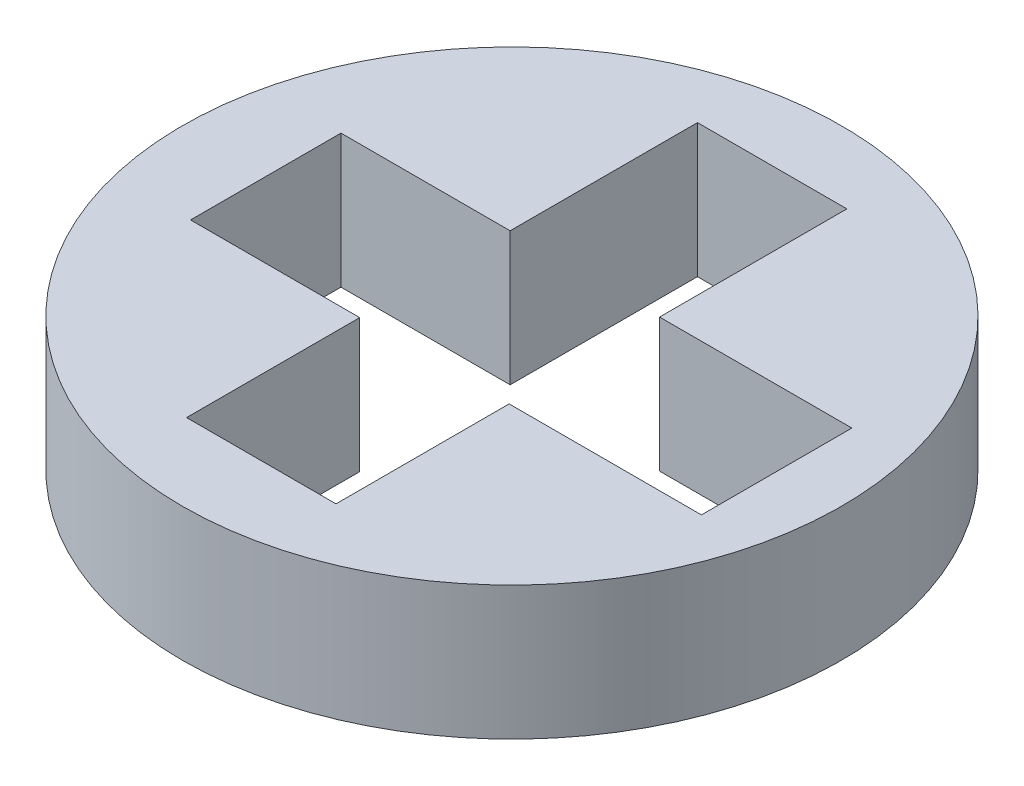
ISO-10303-21;
HEADER;
FILE_DESCRIPTION(('STEP AP214'),'2;1');
FILE_NAME('part.step','',(''),(''),'','','');
FILE_SCHEMA(('AUTOMOTIVE_DESIGN { 1 0 10303 214 1 1 1 1 }'));
ENDSEC;
DATA;
#1=APPLICATION_CONTEXT('core data for automotive mechanical design processes');
#2=APPLICATION_PROTOCOL_DEFINITION('international standard','automotive_design',2000,#1);
#3=PRODUCT_CONTEXT('',#1,'mechanical');
#4=PRODUCT('Part','Part','',(#3));
#5=PRODUCT_RELATED_PRODUCT_CATEGORY('part','',(#4));
#6=PRODUCT_DEFINITION_FORMATION('','',#4);
#7=PRODUCT_DEFINITION_CONTEXT('part definition',#1,'design');
#8=PRODUCT_DEFINITION('design','',#6,#7);
#9=PRODUCT_DEFINITION_SHAPE('','',#8);
#10=(LENGTH_UNIT() NAMED_UNIT(*) SI_UNIT(.MILLI.,.METRE.));
#11=(NAMED_UNIT(*) PLANE_ANGLE_UNIT() SI_UNIT($,.RADIAN.));
#12=(NAMED_UNIT(*) SI_UNIT($,.STERADIAN.) SOLID_ANGLE_UNIT());
#13=UNCERTAINTY_MEASURE_WITH_UNIT(LENGTH_MEASURE(1.E-05),#10,'distance_accuracy_value','');
#14=(GEOMETRIC_REPRESENTATION_CONTEXT(3) GLOBAL_UNCERTAINTY_ASSIGNED_CONTEXT((#13)) GLOBAL_UNIT_ASSIGNED_CONTEXT((#10,
#11,#12)) REPRESENTATION_CONTEXT('',''));
#15=CARTESIAN_POINT('',(0.,0.,0.));
#16=DIRECTION('',(0.,0.,1.));
#17=DIRECTION('',(1.,0.,0.));
#18=AXIS2_PLACEMENT_3D('',#15,#16,#17);
#19=CARTESIAN_POINT('',(0.,1.,-1.95043882679258));
#20=DIRECTION('',(0.,0.,-1.));
#21=DIRECTION('',(-1.,0.,0.));
#22=AXIS2_PLACEMENT_3D('',#19,#20,#21);
#23=PLANE('',#22);
#24=DIRECTION('',(1.,0.,0.));
#25=VECTOR('',#24,1.);
#26=CARTESIAN_POINT('',(0.,0.,-1.95043882679258));
#27=LINE('',#26,#25);
#28=CARTESIAN_POINT('',(-0.56,0.,-1.95043882679258));
#29=VERTEX_POINT('',#28);
#30=CARTESIAN_POINT('',(0.56,0.,-1.95043882679258));
#31=VERTEX_POINT('',#30);
#32=EDGE_CURVE('E176',#29,#31,#27,.T.);
#33=ORIENTED_EDGE('',*,*,#32,.T.);
#34=DIRECTION('',(0.,-1.,0.));
#35=VECTOR('',#34,1.);
#36=CARTESIAN_POINT('',(0.56,1.,-1.95043882679258));
#37=LINE('',#36,#35);
#38=CARTESIAN_POINT('',(0.56,1.,-1.95043882679258));
#39=VERTEX_POINT('',#38);
#40=EDGE_CURVE('E11',#39,#31,#37,.T.);
#41=ORIENTED_EDGE('',*,*,#40,.F.);
#42=DIRECTION('',(1.,0.,0.));
#43=VECTOR('',#42,1.);
#44=CARTESIAN_POINT('',(0.,1.,-1.95043882679258));
#45=LINE('',#44,#43);
#46=CARTESIAN_POINT('',(-0.56,1.,-1.95043882679258));
#47=VERTEX_POINT('',#46);
#48=EDGE_CURVE('E211',#47,#39,#45,.T.);
#49=ORIENTED_EDGE('',*,*,#48,.F.);
#50=DIRECTION('',(0.,-1.,0.));
#51=VECTOR('',#50,1.);
#52=CARTESIAN_POINT('',(-0.56,1.,-1.95043882679258));
#53=LINE('',#52,#51);
#54=EDGE_CURVE('E58',#47,#29,#53,.T.);
#55=ORIENTED_EDGE('',*,*,#54,.T.);
#56=EDGE_LOOP('',(#33,#41,#49,#55));
#57=FACE_BOUND('',#56,.T.);
#58=ADVANCED_FACE('F41',(#57),#23,.F.);
#59=CARTESIAN_POINT('',(0.56,1.,0.));
#60=DIRECTION('',(1.,0.,0.));
#61=DIRECTION('',(0.,0.,-1.));
#62=AXIS2_PLACEMENT_3D('',#59,#60,#61);
#63=PLANE('',#62);
#64=DIRECTION('',(0.,0.,1.));
#65=VECTOR('',#64,1.);
#66=CARTESIAN_POINT('',(0.56,0.,0.));
#67=LINE('',#66,#65);
#68=CARTESIAN_POINT('',(0.56,0.,-0.546492652772135));
#69=VERTEX_POINT('',#68);
#70=EDGE_CURVE('E179',#31,#69,#67,.T.);
#71=ORIENTED_EDGE('',*,*,#70,.T.);
#72=DIRECTION('',(0.,-1.,0.));
#73=VECTOR('',#72,1.);
#74=CARTESIAN_POINT('',(0.56,1.,-0.546492652772135));
#75=LINE('',#74,#73);
#76=CARTESIAN_POINT('',(0.56,1.,-0.546492652772135));
#77=VERTEX_POINT('',#76);
#78=EDGE_CURVE('E50',#77,#69,#75,.T.);
#79=ORIENTED_EDGE('',*,*,#78,.F.);
#80=DIRECTION('',(0.,0.,1.));
#81=VECTOR('',#80,1.);
#82=CARTESIAN_POINT('',(0.56,1.,0.));
#83=LINE('',#82,#81);
#84=EDGE_CURVE('E109',#39,#77,#83,.T.);
#85=ORIENTED_EDGE('',*,*,#84,.F.);
#86=ORIENTED_EDGE('',*,*,#40,.T.);
#87=EDGE_LOOP('',(#71,#79,#85,#86));
#88=FACE_BOUND('',#87,.T.);
#89=ADVANCED_FACE('F276',(#88),#63,.F.);
#90=CARTESIAN_POINT('',(0.,1.,-0.546492652772135));
#91=DIRECTION('',(0.,0.,-1.));
#92=DIRECTION('',(-1.,0.,0.));
#93=AXIS2_PLACEMENT_3D('',#90,#91,#92);
#94=PLANE('',#93);
#95=DIRECTION('',(1.,0.,0.));
#96=VECTOR('',#95,1.);
#97=CARTESIAN_POINT('',(0.,0.,-0.546492652772135));
#98=LINE('',#97,#96);
#99=CARTESIAN_POINT('',(2.00120009186934,0.,-0.546492652772135));
#100=VERTEX_POINT('',#99);
#101=EDGE_CURVE('E182',#69,#100,#98,.T.);
#102=ORIENTED_EDGE('',*,*,#101,.T.);
#103=DIRECTION('',(0.,-1.,0.));
#104=VECTOR('',#103,1.);
#105=CARTESIAN_POINT('',(2.00120009186934,1.,-0.546492652772135));
#106=LINE('',#105,#104);
#107=CARTESIAN_POINT('',(2.00120009186934,1.,-0.546492652772135));
#108=VERTEX_POINT('',#107);
#109=EDGE_CURVE('E233',#108,#100,#106,.T.);
#110=ORIENTED_EDGE('',*,*,#109,.F.);
#111=DIRECTION('',(1.,0.,0.));
#112=VECTOR('',#111,1.);
#113=CARTESIAN_POINT('',(0.,1.,-0.546492652772135));
#114=LINE('',#113,#112);
#115=EDGE_CURVE('E156',#77,#108,#114,.T.);
#116=ORIENTED_EDGE('',*,*,#115,.F.);
#117=ORIENTED_EDGE('',*,*,#78,.T.);
#118=EDGE_LOOP('',(#102,#110,#116,#117));
#119=FACE_BOUND('',#118,.T.);
#120=ADVANCED_FACE('F241',(#119),#94,.F.);
#121=CARTESIAN_POINT('',(2.00120009186934,1.,0.));
#122=DIRECTION('',(1.,0.,0.));
#123=DIRECTION('',(0.,0.,-1.));
#124=AXIS2_PLACEMENT_3D('',#121,#122,#123);
#125=PLANE('',#124);
#126=DIRECTION('',(0.,0.,1.));
#127=VECTOR('',#126,1.);
#128=CARTESIAN_POINT('',(2.00120009186934,0.,0.));
#129=LINE('',#128,#127);
#130=CARTESIAN_POINT('',(2.00120009186934,0.,0.580830581006816));
#131=VERTEX_POINT('',#130);
#132=EDGE_CURVE('E186',#100,#131,#129,.T.);
#133=ORIENTED_EDGE('',*,*,#132,.T.);
#134=DIRECTION('',(0.,-1.,0.));
#135=VECTOR('',#134,1.);
#136=CARTESIAN_POINT('',(2.00120009186934,1.,0.580830581006816));
#137=LINE('',#136,#135);
#138=CARTESIAN_POINT('',(2.00120009186934,1.,0.580830581006816));
#139=VERTEX_POINT('',#138);
#140=EDGE_CURVE('E230',#139,#131,#137,.T.);
#141=ORIENTED_EDGE('',*,*,#140,.F.);
#142=DIRECTION('',(0.,0.,1.));
#143=VECTOR('',#142,1.);
#144=CARTESIAN_POINT('',(2.00120009186934,1.,0.));
#145=LINE('',#144,#143);
#146=EDGE_CURVE('E254',#108,#139,#145,.T.);
#147=ORIENTED_EDGE('',*,*,#146,.F.);
#148=ORIENTED_EDGE('',*,*,#109,.T.);
#149=EDGE_LOOP('',(#133,#141,#147,#148));
#150=FACE_BOUND('',#149,.T.);
#151=ADVANCED_FACE('F251',(#150),#125,.F.);
#152=CARTESIAN_POINT('',(0.,1.,0.580830581006818));
#153=DIRECTION('',(0.,0.,-1.));
#154=DIRECTION('',(-1.,0.,0.));
#155=AXIS2_PLACEMENT_3D('',#152,#153,#154);
#156=PLANE('',#155);
#157=DIRECTION('',(1.,0.,0.));
#158=VECTOR('',#157,1.);
#159=CARTESIAN_POINT('',(0.,0.,0.580830581006818));
#160=LINE('',#159,#158);
#161=CARTESIAN_POINT('',(0.56,0.,0.580830581006817));
#162=VERTEX_POINT('',#161);
#163=EDGE_CURVE('E191',#162,#131,#160,.T.);
#164=ORIENTED_EDGE('',*,*,#163,.F.);
#165=DIRECTION('',(0.,-1.,0.));
#166=VECTOR('',#165,1.);
#167=CARTESIAN_POINT('',(0.56,1.,0.580830581006817));
#168=LINE('',#167,#166);
#169=CARTESIAN_POINT('',(0.56,1.,0.580830581006817));
#170=VERTEX_POINT('',#169);
#171=EDGE_CURVE('E227',#170,#162,#168,.T.);
#172=ORIENTED_EDGE('',*,*,#171,.F.);
#173=DIRECTION('',(1.,0.,0.));
#174=VECTOR('',#173,1.);
#175=CARTESIAN_POINT('',(0.,1.,0.580830581006818));
#176=LINE('',#175,#174);
#177=EDGE_CURVE('E168',#170,#139,#176,.T.);
#178=ORIENTED_EDGE('',*,*,#177,.T.);
#179=ORIENTED_EDGE('',*,*,#140,.T.);
#180=EDGE_LOOP('',(#164,#172,#178,#179));
#181=FACE_BOUND('',#180,.T.);
#182=ADVANCED_FACE('F288',(#181),#156,.T.);
#183=CARTESIAN_POINT('',(0.56,0.,1.87856472751946));
#184=VERTEX_POINT('',#183);
#185=EDGE_CURVE('E183',#162,#184,#67,.T.);
#186=ORIENTED_EDGE('',*,*,#185,.T.);
#187=DIRECTION('',(0.,-1.,0.));
#188=VECTOR('',#187,1.);
#189=CARTESIAN_POINT('',(0.56,1.,1.87856472751946));
#190=LINE('',#189,#188);
#191=CARTESIAN_POINT('',(0.56,1.,1.87856472751946));
#192=VERTEX_POINT('',#191);
#193=EDGE_CURVE('E224',#192,#184,#190,.T.);
#194=ORIENTED_EDGE('',*,*,#193,.F.);
#195=EDGE_CURVE('E260',#170,#192,#83,.T.);
#196=ORIENTED_EDGE('',*,*,#195,.F.);
#197=ORIENTED_EDGE('',*,*,#171,.T.);
#198=EDGE_LOOP('',(#186,#194,#196,#197));
#199=FACE_BOUND('',#198,.T.);
#200=ADVANCED_FACE('F279',(#199),#63,.F.);
#201=CARTESIAN_POINT('',(0.,1.,1.87856472751946));
#202=DIRECTION('',(0.,0.,-1.));
#203=DIRECTION('',(-1.,0.,0.));
#204=AXIS2_PLACEMENT_3D('',#201,#202,#203);
#205=PLANE('',#204);
#206=DIRECTION('',(1.,0.,0.));
#207=VECTOR('',#206,1.);
#208=CARTESIAN_POINT('',(0.,0.,1.87856472751946));
#209=LINE('',#208,#207);
#210=CARTESIAN_POINT('',(-0.56,0.,1.87856472751946));
#211=VERTEX_POINT('',#210);
#212=EDGE_CURVE('E196',#211,#184,#209,.T.);
#213=ORIENTED_EDGE('',*,*,#212,.F.);
#214=DIRECTION('',(0.,-1.,0.));
#215=VECTOR('',#214,1.);
#216=CARTESIAN_POINT('',(-0.56,1.,1.87856472751946));
#217=LINE('',#216,#215);
#218=CARTESIAN_POINT('',(-0.56,1.,1.87856472751946));
#219=VERTEX_POINT('',#218);
#220=EDGE_CURVE('E221',#219,#211,#217,.T.);
#221=ORIENTED_EDGE('',*,*,#220,.F.);
#222=DIRECTION('',(1.,0.,0.));
#223=VECTOR('',#222,1.);
#224=CARTESIAN_POINT('',(0.,1.,1.87856472751946));
#225=LINE('',#224,#223);
#226=EDGE_CURVE('E262',#219,#192,#225,.T.);
#227=ORIENTED_EDGE('',*,*,#226,.T.);
#228=ORIENTED_EDGE('',*,*,#193,.T.);
#229=EDGE_LOOP('',(#213,#221,#227,#228));
#230=FACE_BOUND('',#229,.T.);
#231=ADVANCED_FACE('F287',(#230),#205,.T.);
#232=CARTESIAN_POINT('',(-0.56,1.,0.));
#233=DIRECTION('',(1.,0.,0.));
#234=DIRECTION('',(0.,0.,-1.));
#235=AXIS2_PLACEMENT_3D('',#232,#233,#234);
#236=PLANE('',#235);
#237=DIRECTION('',(0.,0.,1.));
#238=VECTOR('',#237,1.);
#239=CARTESIAN_POINT('',(-0.56,0.,0.));
#240=LINE('',#239,#238);
#241=CARTESIAN_POINT('',(-0.56,0.,0.580830581006818));
#242=VERTEX_POINT('',#241);
#243=EDGE_CURVE('E200',#242,#211,#240,.T.);
#244=ORIENTED_EDGE('',*,*,#243,.F.);
#245=DIRECTION('',(0.,-1.,0.));
#246=VECTOR('',#245,1.);
#247=CARTESIAN_POINT('',(-0.56,1.,0.580830581006818));
#248=LINE('',#247,#246);
#249=CARTESIAN_POINT('',(-0.56,1.,0.580830581006818));
#250=VERTEX_POINT('',#249);
#251=EDGE_CURVE('E218',#250,#242,#248,.T.);
#252=ORIENTED_EDGE('',*,*,#251,.F.);
#253=DIRECTION('',(0.,0.,1.));
#254=VECTOR('',#253,1.);
#255=CARTESIAN_POINT('',(-0.56,1.,0.));
#256=LINE('',#255,#254);
#257=EDGE_CURVE('E166',#250,#219,#256,.T.);
#258=ORIENTED_EDGE('',*,*,#257,.T.);
#259=ORIENTED_EDGE('',*,*,#220,.T.);
#260=EDGE_LOOP('',(#244,#252,#258,#259));
#261=FACE_BOUND('',#260,.T.);
#262=ADVANCED_FACE('F294',(#261),#236,.T.);
#263=CARTESIAN_POINT('',(-1.82780345813066,0.,0.580830581006819));
#264=VERTEX_POINT('',#263);
#265=EDGE_CURVE('E195',#264,#242,#160,.T.);
#266=ORIENTED_EDGE('',*,*,#265,.F.);
#267=DIRECTION('',(0.,-1.,0.));
#268=VECTOR('',#267,1.);
#269=CARTESIAN_POINT('',(-1.82780345813066,1.,0.580830581006819));
#270=LINE('',#269,#268);
#271=CARTESIAN_POINT('',(-1.82780345813066,1.,0.580830581006819));
#272=VERTEX_POINT('',#271);
#273=EDGE_CURVE('E147',#272,#264,#270,.T.);
#274=ORIENTED_EDGE('',*,*,#273,.F.);
#275=EDGE_CURVE('E162',#272,#250,#176,.T.);
#276=ORIENTED_EDGE('',*,*,#275,.T.);
#277=ORIENTED_EDGE('',*,*,#251,.T.);
#278=EDGE_LOOP('',(#266,#274,#276,#277));
#279=FACE_BOUND('',#278,.T.);
#280=ADVANCED_FACE('F297',(#279),#156,.T.);
#281=CARTESIAN_POINT('',(-1.82780345813066,1.,0.));
#282=DIRECTION('',(1.,0.,0.));
#283=DIRECTION('',(0.,0.,-1.));
#284=AXIS2_PLACEMENT_3D('',#281,#282,#283);
#285=PLANE('',#284);
#286=DIRECTION('',(0.,0.,1.));
#287=VECTOR('',#286,1.);
#288=CARTESIAN_POINT('',(-1.82780345813066,0.,0.));
#289=LINE('',#288,#287);
#290=CARTESIAN_POINT('',(-1.82780345813066,0.,-0.546492652772135));
#291=VERTEX_POINT('',#290);
#292=EDGE_CURVE('E143',#291,#264,#289,.T.);
#293=ORIENTED_EDGE('',*,*,#292,.F.);
#294=DIRECTION('',(0.,-1.,0.));
#295=VECTOR('',#294,1.);
#296=CARTESIAN_POINT('',(-1.82780345813066,1.,-0.546492652772135));
#297=LINE('',#296,#295);
#298=CARTESIAN_POINT('',(-1.82780345813066,1.,-0.546492652772135));
#299=VERTEX_POINT('',#298);
#300=EDGE_CURVE('E137',#299,#291,#297,.T.);
#301=ORIENTED_EDGE('',*,*,#300,.F.);
#302=DIRECTION('',(0.,0.,1.));
#303=VECTOR('',#302,1.);
#304=CARTESIAN_POINT('',(-1.82780345813066,1.,0.));
#305=LINE('',#304,#303);
#306=EDGE_CURVE('E141',#299,#272,#305,.T.);
#307=ORIENTED_EDGE('',*,*,#306,.T.);
#308=ORIENTED_EDGE('',*,*,#273,.T.);
#309=EDGE_LOOP('',(#293,#301,#307,#308));
#310=FACE_BOUND('',#309,.T.);
#311=ADVANCED_FACE('F139',(#310),#285,.T.);
#312=CARTESIAN_POINT('',(-0.56,0.,-0.546492652772135));
#313=VERTEX_POINT('',#312);
#314=EDGE_CURVE('E187',#291,#313,#98,.T.);
#315=ORIENTED_EDGE('',*,*,#314,.T.);
#316=DIRECTION('',(0.,-1.,0.));
#317=VECTOR('',#316,1.);
#318=CARTESIAN_POINT('',(-0.56,1.,-0.546492652772135));
#319=LINE('',#318,#317);
#320=CARTESIAN_POINT('',(-0.56,1.,-0.546492652772135));
#321=VERTEX_POINT('',#320);
#322=EDGE_CURVE('E97',#321,#313,#319,.T.);
#323=ORIENTED_EDGE('',*,*,#322,.F.);
#324=EDGE_CURVE('E149',#299,#321,#114,.T.);
#325=ORIENTED_EDGE('',*,*,#324,.F.);
#326=ORIENTED_EDGE('',*,*,#300,.T.);
#327=EDGE_LOOP('',(#315,#323,#325,#326));
#328=FACE_BOUND('',#327,.T.);
#329=ADVANCED_FACE('F150',(#328),#94,.F.);
#330=EDGE_CURVE('E204',#29,#313,#240,.T.);
#331=ORIENTED_EDGE('',*,*,#330,.F.);
#332=ORIENTED_EDGE('',*,*,#54,.F.);
#333=EDGE_CURVE('E154',#47,#321,#256,.T.);
#334=ORIENTED_EDGE('',*,*,#333,.T.);
#335=ORIENTED_EDGE('',*,*,#322,.T.);
#336=EDGE_LOOP('',(#331,#332,#334,#335));
#337=FACE_BOUND('',#336,.T.);
#338=ADVANCED_FACE('F310',(#337),#236,.T.);
#339=CARTESIAN_POINT('',(0.,1.,0.));
#340=DIRECTION('',(0.,-1.,0.));
#341=DIRECTION('',(0.,0.,-1.));
#342=AXIS2_PLACEMENT_3D('',#339,#340,#341);
#343=CYLINDRICAL_SURFACE('',#342,2.47);
#344=CARTESIAN_POINT('',(0.,1.,0.));
#345=DIRECTION('',(0.,1.,0.));
#346=DIRECTION('',(0.,0.,1.));
#347=AXIS2_PLACEMENT_3D('',#344,#345,#346);
#348=CIRCLE('',#347,2.47);
#349=CARTESIAN_POINT('',(0.,1.,2.47));
#350=VERTEX_POINT('',#349);
#351=EDGE_CURVE('E172',#350,#350,#348,.T.);
#352=ORIENTED_EDGE('',*,*,#351,.F.);
#353=EDGE_LOOP('',(#352));
#354=FACE_BOUND('',#353,.T.);
#355=CARTESIAN_POINT('',(0.,0.,0.));
#356=DIRECTION('',(0.,1.,0.));
#357=DIRECTION('',(0.,0.,1.));
#358=AXIS2_PLACEMENT_3D('',#355,#356,#357);
#359=CIRCLE('',#358,2.47);
#360=CARTESIAN_POINT('',(0.,0.,2.47));
#361=VERTEX_POINT('',#360);
#362=EDGE_CURVE('E207',#361,#361,#359,.T.);
#363=ORIENTED_EDGE('',*,*,#362,.T.);
#364=EDGE_LOOP('',(#363));
#365=FACE_BOUND('',#364,.T.);
#366=ADVANCED_FACE('F312',(#354,#365),#343,.T.);
#367=CARTESIAN_POINT('',(0.,1.,0.));
#368=DIRECTION('',(0.,1.,0.));
#369=DIRECTION('',(0.,0.,1.));
#370=AXIS2_PLACEMENT_3D('',#367,#368,#369);
#371=PLANE('',#370);
#372=ORIENTED_EDGE('',*,*,#48,.T.);
#373=ORIENTED_EDGE('',*,*,#84,.T.);
#374=ORIENTED_EDGE('',*,*,#115,.T.);
#375=ORIENTED_EDGE('',*,*,#146,.T.);
#376=ORIENTED_EDGE('',*,*,#177,.F.);
#377=ORIENTED_EDGE('',*,*,#195,.T.);
#378=ORIENTED_EDGE('',*,*,#226,.F.);
#379=ORIENTED_EDGE('',*,*,#257,.F.);
#380=ORIENTED_EDGE('',*,*,#275,.F.);
#381=ORIENTED_EDGE('',*,*,#306,.F.);
#382=ORIENTED_EDGE('',*,*,#324,.T.);
#383=ORIENTED_EDGE('',*,*,#333,.F.);
#384=EDGE_LOOP('',(#372,#373,#374,#375,#376,#377,#378,#379,#380,#381,#382,#383));
#385=FACE_BOUND('',#384,.T.);
#386=ORIENTED_EDGE('',*,*,#351,.T.);
#387=EDGE_LOOP('',(#386));
#388=FACE_BOUND('',#387,.T.);
#389=ADVANCED_FACE('F158',(#385,#388),#371,.T.);
#390=CARTESIAN_POINT('',(0.,0.,0.));
#391=DIRECTION('',(0.,1.,0.));
#392=DIRECTION('',(0.,0.,1.));
#393=AXIS2_PLACEMENT_3D('',#390,#391,#392);
#394=PLANE('',#393);
#395=ORIENTED_EDGE('',*,*,#32,.F.);
#396=ORIENTED_EDGE('',*,*,#330,.T.);
#397=ORIENTED_EDGE('',*,*,#314,.F.);
#398=ORIENTED_EDGE('',*,*,#292,.T.);
#399=ORIENTED_EDGE('',*,*,#265,.T.);
#400=ORIENTED_EDGE('',*,*,#243,.T.);
#401=ORIENTED_EDGE('',*,*,#212,.T.);
#402=ORIENTED_EDGE('',*,*,#185,.F.);
#403=ORIENTED_EDGE('',*,*,#163,.T.);
#404=ORIENTED_EDGE('',*,*,#132,.F.);
#405=ORIENTED_EDGE('',*,*,#101,.F.);
#406=ORIENTED_EDGE('',*,*,#70,.F.);
#407=EDGE_LOOP('',(#395,#396,#397,#398,#399,#400,#401,#402,#403,#404,#405,#406));
#408=FACE_BOUND('',#407,.T.);
#409=ORIENTED_EDGE('',*,*,#362,.F.);
#410=EDGE_LOOP('',(#409));
#411=FACE_BOUND('',#410,.T.);
#412=ADVANCED_FACE('F245',(#408,#411),#394,.F.);
#413=CLOSED_SHELL('',(#58,#89,#120,#151,#182,#200,#231,#262,#280,#311,#329,#338,#366,#389,#412));
#414=MANIFOLD_SOLID_BREP('B2',#413);
#415=ADVANCED_BREP_SHAPE_REPRESENTATION('',(#18,#414),#14);
#416=SHAPE_DEFINITION_REPRESENTATION(#9,#415);
ENDSEC;
END-ISO-10303-21;
